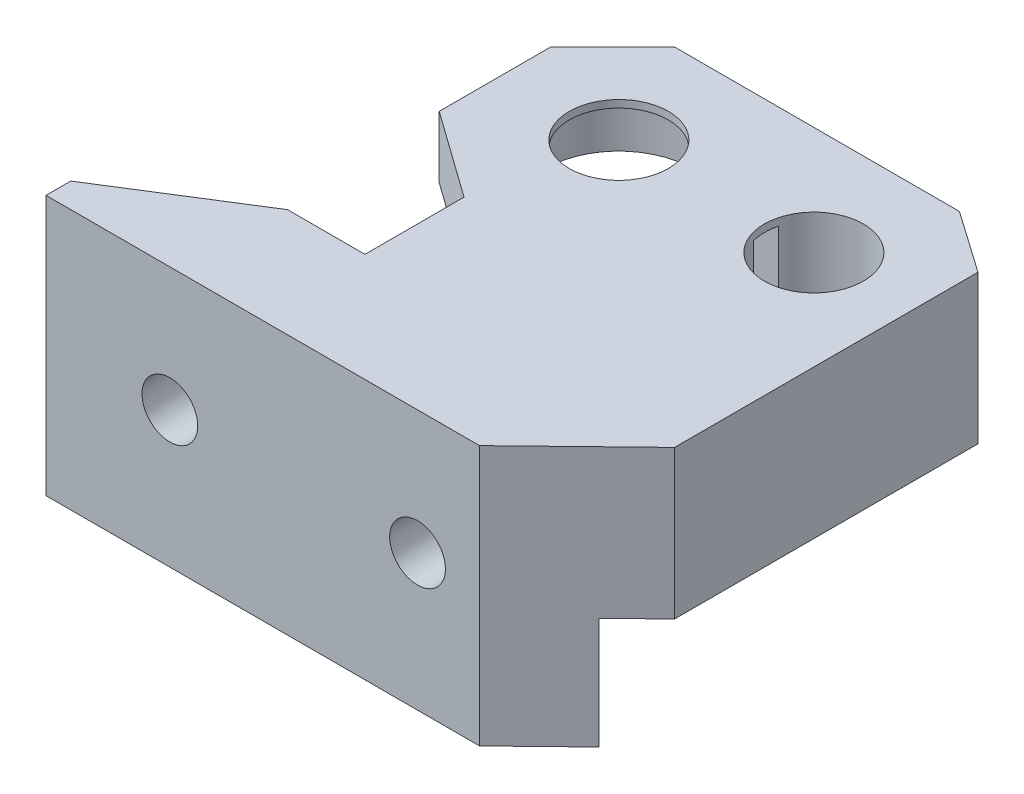
ISO-10303-21;
HEADER;
FILE_DESCRIPTION(('STEP AP214'),'2;1');
FILE_NAME('part.step','',(''),(''),'','','');
FILE_SCHEMA(('AUTOMOTIVE_DESIGN { 1 0 10303 214 1 1 1 1 }'));
ENDSEC;
DATA;
#1=APPLICATION_CONTEXT('core data for automotive mechanical design processes');
#2=APPLICATION_PROTOCOL_DEFINITION('international standard','automotive_design',2000,#1);
#3=PRODUCT_CONTEXT('',#1,'mechanical');
#4=PRODUCT('Part','Part','',(#3));
#5=PRODUCT_RELATED_PRODUCT_CATEGORY('part','',(#4));
#6=PRODUCT_DEFINITION_FORMATION('','',#4);
#7=PRODUCT_DEFINITION_CONTEXT('part definition',#1,'design');
#8=PRODUCT_DEFINITION('design','',#6,#7);
#9=PRODUCT_DEFINITION_SHAPE('','',#8);
#10=(LENGTH_UNIT() NAMED_UNIT(*) SI_UNIT(.MILLI.,.METRE.));
#11=(NAMED_UNIT(*) PLANE_ANGLE_UNIT() SI_UNIT($,.RADIAN.));
#12=(NAMED_UNIT(*) SI_UNIT($,.STERADIAN.) SOLID_ANGLE_UNIT());
#13=UNCERTAINTY_MEASURE_WITH_UNIT(LENGTH_MEASURE(1.E-05),#10,'distance_accuracy_value','');
#14=(GEOMETRIC_REPRESENTATION_CONTEXT(3) GLOBAL_UNCERTAINTY_ASSIGNED_CONTEXT((#13)) GLOBAL_UNIT_ASSIGNED_CONTEXT((#10,
#11,#12)) REPRESENTATION_CONTEXT('',''));
#15=CARTESIAN_POINT('',(0.,0.,0.));
#16=DIRECTION('',(0.,0.,1.));
#17=DIRECTION('',(1.,0.,0.));
#18=AXIS2_PLACEMENT_3D('',#15,#16,#17);
#19=CARTESIAN_POINT('',(-9.25,-5.,-8.75));
#20=DIRECTION('',(0.,0.,1.));
#21=DIRECTION('',(1.,0.,0.));
#22=AXIS2_PLACEMENT_3D('',#19,#20,#21);
#23=CYLINDRICAL_SURFACE('',#22,2.25);
#24=CARTESIAN_POINT('',(-9.25,-5.,27.));
#25=DIRECTION('',(0.,0.,1.));
#26=DIRECTION('',(1.,0.,0.));
#27=AXIS2_PLACEMENT_3D('',#24,#25,#26);
#28=CIRCLE('',#27,2.25);
#29=CARTESIAN_POINT('',(-7.,-5.,27.));
#30=VERTEX_POINT('',#29);
#31=EDGE_CURVE('E579',#30,#30,#28,.T.);
#32=ORIENTED_EDGE('',*,*,#31,.T.);
#33=EDGE_LOOP('',(#32));
#34=FACE_BOUND('',#33,.T.);
#35=CARTESIAN_POINT('',(-9.25,-5.,22.25));
#36=DIRECTION('',(0.,0.,1.));
#37=DIRECTION('',(1.,0.,0.));
#38=AXIS2_PLACEMENT_3D('',#35,#36,#37);
#39=CIRCLE('',#38,2.25);
#40=CARTESIAN_POINT('',(-7.,-5.,22.25));
#41=VERTEX_POINT('',#40);
#42=EDGE_CURVE('E40',#41,#41,#39,.T.);
#43=ORIENTED_EDGE('',*,*,#42,.F.);
#44=EDGE_LOOP('',(#43));
#45=FACE_BOUND('',#44,.T.);
#46=ADVANCED_FACE('F32',(#34,#45),#23,.F.);
#47=CARTESIAN_POINT('',(10.75,-5.,-8.75));
#48=DIRECTION('',(0.,0.,1.));
#49=DIRECTION('',(1.,0.,0.));
#50=AXIS2_PLACEMENT_3D('',#47,#48,#49);
#51=CYLINDRICAL_SURFACE('',#50,2.25);
#52=CARTESIAN_POINT('',(10.75,-5.,27.));
#53=DIRECTION('',(0.,0.,1.));
#54=DIRECTION('',(1.,0.,0.));
#55=AXIS2_PLACEMENT_3D('',#52,#53,#54);
#56=CIRCLE('',#55,2.25);
#57=CARTESIAN_POINT('',(13.,-5.,27.));
#58=VERTEX_POINT('',#57);
#59=EDGE_CURVE('E580',#58,#58,#56,.T.);
#60=ORIENTED_EDGE('',*,*,#59,.T.);
#61=EDGE_LOOP('',(#60));
#62=FACE_BOUND('',#61,.T.);
#63=CARTESIAN_POINT('',(10.75,-5.,22.25));
#64=DIRECTION('',(0.,0.,1.));
#65=DIRECTION('',(1.,0.,0.));
#66=AXIS2_PLACEMENT_3D('',#63,#64,#65);
#67=CIRCLE('',#66,2.25);
#68=CARTESIAN_POINT('',(13.,-5.,22.25));
#69=VERTEX_POINT('',#68);
#70=EDGE_CURVE('E11',#69,#69,#67,.T.);
#71=ORIENTED_EDGE('',*,*,#70,.F.);
#72=EDGE_LOOP('',(#71));
#73=FACE_BOUND('',#72,.T.);
#74=ADVANCED_FACE('F373',(#62,#73),#51,.F.);
#75=CARTESIAN_POINT('',(0.,-7.,0.));
#76=DIRECTION('',(0.,1.,0.));
#77=DIRECTION('',(0.,0.,1.));
#78=AXIS2_PLACEMENT_3D('',#75,#76,#77);
#79=PLANE('',#78);
#80=DIRECTION('',(1.,0.,0.));
#81=VECTOR('',#80,1.);
#82=CARTESIAN_POINT('',(20.25,-7.,18.25));
#83=LINE('',#82,#81);
#84=CARTESIAN_POINT('',(-5.78589838486224,-7.,18.25));
#85=VERTEX_POINT('',#84);
#86=CARTESIAN_POINT('',(7.28589838486225,-7.,18.25));
#87=VERTEX_POINT('',#86);
#88=EDGE_CURVE('E248',#85,#87,#83,.T.);
#89=ORIENTED_EDGE('',*,*,#88,.T.);
#90=DIRECTION('',(0.,0.,-1.));
#91=VECTOR('',#90,1.);
#92=CARTESIAN_POINT('',(7.28589838486225,-7.,22.25));
#93=LINE('',#92,#91);
#94=CARTESIAN_POINT('',(7.28589838486225,-7.,22.25));
#95=VERTEX_POINT('',#94);
#96=EDGE_CURVE('E226',#87,#95,#93,.F.);
#97=ORIENTED_EDGE('',*,*,#96,.T.);
#98=DIRECTION('',(-1.,0.,0.));
#99=VECTOR('',#98,1.);
#100=CARTESIAN_POINT('',(-14.8703703703704,-7.,22.25));
#101=LINE('',#100,#99);
#102=CARTESIAN_POINT('',(-5.78589838486224,-7.,22.25));
#103=VERTEX_POINT('',#102);
#104=EDGE_CURVE('E554',#95,#103,#101,.T.);
#105=ORIENTED_EDGE('',*,*,#104,.T.);
#106=DIRECTION('',(0.,0.,-1.));
#107=VECTOR('',#106,1.);
#108=CARTESIAN_POINT('',(-5.78589838486224,-7.,22.25));
#109=LINE('',#108,#107);
#110=EDGE_CURVE('E241',#103,#85,#109,.T.);
#111=ORIENTED_EDGE('',*,*,#110,.T.);
#112=EDGE_LOOP('',(#89,#97,#105,#111));
#113=FACE_BOUND('',#112,.T.);
#114=ADVANCED_FACE('F379',(#113),#79,.F.);
#115=DIRECTION('',(0.846889988853068,0.,-0.531768132535647));
#116=VECTOR('',#115,1.);
#117=CARTESIAN_POINT('',(-8.5,-7.,18.25));
#118=LINE('',#117,#116);
#119=CARTESIAN_POINT('',(-14.8703703703704,-7.,22.25));
#120=VERTEX_POINT('',#119);
#121=CARTESIAN_POINT('',(-12.7141016151378,-7.,20.8960638048539));
#122=VERTEX_POINT('',#121);
#123=EDGE_CURVE('E249',#120,#122,#118,.T.);
#124=ORIENTED_EDGE('',*,*,#123,.T.);
#125=DIRECTION('',(0.,0.,-1.));
#126=VECTOR('',#125,1.);
#127=CARTESIAN_POINT('',(-12.7141016151378,-7.,22.25));
#128=LINE('',#127,#126);
#129=CARTESIAN_POINT('',(-12.7141016151378,-7.,22.25));
#130=VERTEX_POINT('',#129);
#131=EDGE_CURVE('E560',#122,#130,#128,.F.);
#132=ORIENTED_EDGE('',*,*,#131,.T.);
#133=EDGE_CURVE('E553',#130,#120,#101,.T.);
#134=ORIENTED_EDGE('',*,*,#133,.T.);
#135=EDGE_LOOP('',(#124,#132,#134));
#136=FACE_BOUND('',#135,.T.);
#137=ADVANCED_FACE('F421',(#136),#79,.F.);
#138=CARTESIAN_POINT('',(15.75,5.,0.));
#139=DIRECTION('',(0.,-1.,0.));
#140=DIRECTION('',(0.,0.,-1.));
#141=AXIS2_PLACEMENT_3D('',#138,#139,#140);
#142=CYLINDRICAL_SURFACE('',#141,4.);
#143=CARTESIAN_POINT('',(15.75,5.,0.));
#144=DIRECTION('',(0.,1.,0.));
#145=DIRECTION('',(0.,0.,1.));
#146=AXIS2_PLACEMENT_3D('',#143,#144,#145);
#147=CIRCLE('',#146,4.);
#148=CARTESIAN_POINT('',(15.75,5.,4.));
#149=VERTEX_POINT('',#148);
#150=EDGE_CURVE('E279',#149,#149,#147,.T.);
#151=ORIENTED_EDGE('',*,*,#150,.T.);
#152=EDGE_LOOP('',(#151));
#153=FACE_BOUND('',#152,.T.);
#154=DIRECTION('',(0.,-1.,0.));
#155=VECTOR('',#154,1.);
#156=CARTESIAN_POINT('',(11.8770166537926,5.,-1.));
#157=LINE('',#156,#155);
#158=CARTESIAN_POINT('',(11.8770166537926,-2.5,-1.));
#159=VERTEX_POINT('',#158);
#160=CARTESIAN_POINT('',(11.8770166537926,4.4,-1.));
#161=VERTEX_POINT('',#160);
#162=EDGE_CURVE('E360',#159,#161,#157,.F.);
#163=ORIENTED_EDGE('',*,*,#162,.F.);
#164=CARTESIAN_POINT('',(15.75,-2.5,0.));
#165=DIRECTION('',(0.,-1.,0.));
#166=DIRECTION('',(0.,0.,-1.));
#167=AXIS2_PLACEMENT_3D('',#164,#165,#166);
#168=CIRCLE('',#167,4.);
#169=CARTESIAN_POINT('',(11.8770166537926,-2.5,0.999999999999999));
#170=VERTEX_POINT('',#169);
#171=EDGE_CURVE('E522',#159,#170,#168,.T.);
#172=ORIENTED_EDGE('',*,*,#171,.T.);
#173=DIRECTION('',(0.,-1.,0.));
#174=VECTOR('',#173,1.);
#175=CARTESIAN_POINT('',(11.8770166537926,5.,1.));
#176=LINE('',#175,#174);
#177=CARTESIAN_POINT('',(11.8770166537926,4.4,1.));
#178=VERTEX_POINT('',#177);
#179=EDGE_CURVE('E362',#178,#170,#176,.T.);
#180=ORIENTED_EDGE('',*,*,#179,.F.);
#181=CARTESIAN_POINT('',(15.75,4.4,0.));
#182=DIRECTION('',(0.,-1.,0.));
#183=DIRECTION('',(0.,0.,-1.));
#184=AXIS2_PLACEMENT_3D('',#181,#182,#183);
#185=CIRCLE('',#184,4.);
#186=EDGE_CURVE('E364',#178,#161,#185,.T.);
#187=ORIENTED_EDGE('',*,*,#186,.T.);
#188=EDGE_LOOP('',(#163,#172,#180,#187));
#189=FACE_BOUND('',#188,.T.);
#190=ADVANCED_FACE('F406',(#153,#189),#142,.F.);
#191=CARTESIAN_POINT('',(15.75,-2.5,0.));
#192=DIRECTION('',(0.,-1.,0.));
#193=DIRECTION('',(0.,0.,-1.));
#194=AXIS2_PLACEMENT_3D('',#191,#192,#193);
#195=PLANE('',#194);
#196=ORIENTED_EDGE('',*,*,#171,.F.);
#197=DIRECTION('',(-1.,0.,0.));
#198=VECTOR('',#197,1.);
#199=CARTESIAN_POINT('',(15.75,-2.5,-1.));
#200=LINE('',#199,#198);
#201=CARTESIAN_POINT('',(8.82179676972449,-2.5,-1.));
#202=VERTEX_POINT('',#201);
#203=EDGE_CURVE('E591',#159,#202,#200,.T.);
#204=ORIENTED_EDGE('',*,*,#203,.T.);
#205=CARTESIAN_POINT('',(15.75,-2.5,0.));
#206=DIRECTION('',(0.,-1.,0.));
#207=DIRECTION('',(0.,0.,-1.));
#208=AXIS2_PLACEMENT_3D('',#205,#206,#207);
#209=CIRCLE('',#208,7.);
#210=CARTESIAN_POINT('',(20.380064794363,-2.5,-5.25));
#211=VERTEX_POINT('',#210);
#212=EDGE_CURVE('E524',#202,#211,#209,.T.);
#213=ORIENTED_EDGE('',*,*,#212,.T.);
#214=DIRECTION('',(1.,0.,0.));
#215=VECTOR('',#214,1.);
#216=CARTESIAN_POINT('',(23.75,-2.5,-5.25));
#217=LINE('',#216,#215);
#218=CARTESIAN_POINT('',(20.25,-2.5,-5.25));
#219=VERTEX_POINT('',#218);
#220=EDGE_CURVE('E357',#219,#211,#217,.T.);
#221=ORIENTED_EDGE('',*,*,#220,.F.);
#222=DIRECTION('',(0.,0.,-1.));
#223=VECTOR('',#222,1.);
#224=CARTESIAN_POINT('',(20.25,-2.5,-5.25));
#225=LINE('',#224,#223);
#226=CARTESIAN_POINT('',(20.25,-2.5,5.3619026473818));
#227=VERTEX_POINT('',#226);
#228=EDGE_CURVE('E532',#227,#219,#225,.T.);
#229=ORIENTED_EDGE('',*,*,#228,.F.);
#230=CARTESIAN_POINT('',(8.82179676972449,-2.5,1.));
#231=VERTEX_POINT('',#230);
#232=EDGE_CURVE('E530',#227,#231,#209,.T.);
#233=ORIENTED_EDGE('',*,*,#232,.T.);
#234=DIRECTION('',(1.,0.,0.));
#235=VECTOR('',#234,1.);
#236=CARTESIAN_POINT('',(15.75,-2.5,0.999999999999999));
#237=LINE('',#236,#235);
#238=EDGE_CURVE('E586',#231,#170,#237,.T.);
#239=ORIENTED_EDGE('',*,*,#238,.T.);
#240=EDGE_LOOP('',(#196,#204,#213,#221,#229,#233,#239));
#241=FACE_BOUND('',#240,.T.);
#242=ADVANCED_FACE('F402',(#241),#195,.T.);
#243=CARTESIAN_POINT('',(15.75,-2.5,0.));
#244=DIRECTION('',(0.,1.,0.));
#245=DIRECTION('',(0.,0.,1.));
#246=AXIS2_PLACEMENT_3D('',#243,#244,#245);
#247=CYLINDRICAL_SURFACE('',#246,7.);
#248=DIRECTION('',(0.,1.,0.));
#249=VECTOR('',#248,1.);
#250=CARTESIAN_POINT('',(8.82179676972449,-2.5,-1.));
#251=LINE('',#250,#249);
#252=CARTESIAN_POINT('',(8.82179676972449,0.,-1.));
#253=VERTEX_POINT('',#252);
#254=EDGE_CURVE('E589',#253,#202,#251,.F.);
#255=ORIENTED_EDGE('',*,*,#254,.F.);
#256=CARTESIAN_POINT('',(15.75,0.,0.));
#257=DIRECTION('',(0.,-1.,0.));
#258=DIRECTION('',(0.,0.,-1.));
#259=AXIS2_PLACEMENT_3D('',#256,#257,#258);
#260=CIRCLE('',#259,7.);
#261=CARTESIAN_POINT('',(20.380064794363,0.,-5.25));
#262=VERTEX_POINT('',#261);
#263=EDGE_CURVE('E519',#253,#262,#260,.T.);
#264=ORIENTED_EDGE('',*,*,#263,.T.);
#265=DIRECTION('',(0.,1.,0.));
#266=VECTOR('',#265,1.);
#267=CARTESIAN_POINT('',(20.380064794363,-2.5,-5.25));
#268=LINE('',#267,#266);
#269=EDGE_CURVE('E265',#262,#211,#268,.F.);
#270=ORIENTED_EDGE('',*,*,#269,.T.);
#271=ORIENTED_EDGE('',*,*,#212,.F.);
#272=EDGE_LOOP('',(#255,#264,#270,#271));
#273=FACE_BOUND('',#272,.T.);
#274=ADVANCED_FACE('F405',(#273),#247,.T.);
#275=DIRECTION('',(0.,1.,0.));
#276=VECTOR('',#275,1.);
#277=CARTESIAN_POINT('',(8.82179676972449,-2.5,1.));
#278=LINE('',#277,#276);
#279=CARTESIAN_POINT('',(8.82179676972449,0.,1.));
#280=VERTEX_POINT('',#279);
#281=EDGE_CURVE('E583',#231,#280,#278,.T.);
#282=ORIENTED_EDGE('',*,*,#281,.F.);
#283=ORIENTED_EDGE('',*,*,#232,.F.);
#284=DIRECTION('',(0.,1.,0.));
#285=VECTOR('',#284,1.);
#286=CARTESIAN_POINT('',(20.25,-2.5,5.3619026473818));
#287=LINE('',#286,#285);
#288=CARTESIAN_POINT('',(20.25,0.,5.3619026473818));
#289=VERTEX_POINT('',#288);
#290=EDGE_CURVE('E47',#227,#289,#287,.T.);
#291=ORIENTED_EDGE('',*,*,#290,.T.);
#292=EDGE_CURVE('E55',#289,#280,#260,.T.);
#293=ORIENTED_EDGE('',*,*,#292,.T.);
#294=EDGE_LOOP('',(#282,#283,#291,#293));
#295=FACE_BOUND('',#294,.T.);
#296=ADVANCED_FACE('F410',(#295),#247,.T.);
#297=CARTESIAN_POINT('',(0.,5.,0.));
#298=DIRECTION('',(0.,-1.,0.));
#299=DIRECTION('',(0.,0.,-1.));
#300=AXIS2_PLACEMENT_3D('',#297,#298,#299);
#301=CYLINDRICAL_SURFACE('',#300,4.);
#302=CARTESIAN_POINT('',(0.,5.,0.));
#303=DIRECTION('',(0.,1.,0.));
#304=DIRECTION('',(0.,0.,1.));
#305=AXIS2_PLACEMENT_3D('',#302,#303,#304);
#306=CIRCLE('',#305,4.);
#307=CARTESIAN_POINT('',(0.,5.,4.));
#308=VERTEX_POINT('',#307);
#309=EDGE_CURVE('E282',#308,#308,#306,.T.);
#310=ORIENTED_EDGE('',*,*,#309,.T.);
#311=EDGE_LOOP('',(#310));
#312=FACE_BOUND('',#311,.T.);
#313=CARTESIAN_POINT('',(0.,4.4,0.));
#314=DIRECTION('',(0.,-1.,0.));
#315=DIRECTION('',(0.,0.,-1.));
#316=AXIS2_PLACEMENT_3D('',#313,#314,#315);
#317=CIRCLE('',#316,4.);
#318=CARTESIAN_POINT('',(0.,4.4,-4.));
#319=VERTEX_POINT('',#318);
#320=EDGE_CURVE('E526',#319,#319,#317,.T.);
#321=ORIENTED_EDGE('',*,*,#320,.T.);
#322=EDGE_LOOP('',(#321));
#323=FACE_BOUND('',#322,.T.);
#324=ADVANCED_FACE('F432',(#312,#323),#301,.F.);
#325=CARTESIAN_POINT('',(0.,0.,0.));
#326=DIRECTION('',(0.,1.,0.));
#327=DIRECTION('',(0.,0.,1.));
#328=AXIS2_PLACEMENT_3D('',#325,#326,#327);
#329=PLANE('',#328);
#330=CARTESIAN_POINT('',(0.,0.,0.));
#331=DIRECTION('',(0.,-1.,0.));
#332=DIRECTION('',(0.,0.,-1.));
#333=AXIS2_PLACEMENT_3D('',#330,#331,#332);
#334=CIRCLE('',#333,5.96815667340306);
#335=CARTESIAN_POINT('',(5.88378229358339,0.,1.));
#336=VERTEX_POINT('',#335);
#337=CARTESIAN_POINT('',(5.88378229358339,0.,-1.));
#338=VERTEX_POINT('',#337);
#339=EDGE_CURVE('E594',#336,#338,#334,.T.);
#340=ORIENTED_EDGE('',*,*,#339,.F.);
#341=DIRECTION('',(-1.,0.,0.));
#342=VECTOR('',#341,1.);
#343=CARTESIAN_POINT('',(5.88378229358339,0.,1.));
#344=LINE('',#343,#342);
#345=EDGE_CURVE('E599',#280,#336,#344,.T.);
#346=ORIENTED_EDGE('',*,*,#345,.F.);
#347=ORIENTED_EDGE('',*,*,#292,.F.);
#348=DIRECTION('',(0.,0.,-1.));
#349=VECTOR('',#348,1.);
#350=CARTESIAN_POINT('',(20.25,0.,-5.25));
#351=LINE('',#350,#349);
#352=CARTESIAN_POINT('',(20.25,0.,18.25));
#353=VERTEX_POINT('',#352);
#354=EDGE_CURVE('E267',#353,#289,#351,.T.);
#355=ORIENTED_EDGE('',*,*,#354,.F.);
#356=DIRECTION('',(1.,0.,0.));
#357=VECTOR('',#356,1.);
#358=CARTESIAN_POINT('',(20.25,0.,18.25));
#359=LINE('',#358,#357);
#360=CARTESIAN_POINT('',(-2.25,0.,18.25));
#361=VERTEX_POINT('',#360);
#362=EDGE_CURVE('E263',#361,#353,#359,.T.);
#363=ORIENTED_EDGE('',*,*,#362,.F.);
#364=DIRECTION('',(0.,0.,1.));
#365=VECTOR('',#364,1.);
#366=CARTESIAN_POINT('',(-2.25,0.,18.25));
#367=LINE('',#366,#365);
#368=CARTESIAN_POINT('',(-2.25,0.,10.25));
#369=VERTEX_POINT('',#368);
#370=EDGE_CURVE('E319',#369,#361,#367,.T.);
#371=ORIENTED_EDGE('',*,*,#370,.F.);
#372=DIRECTION('',(0.813733471206735,0.,0.581238193719096));
#373=VECTOR('',#372,1.);
#374=CARTESIAN_POINT('',(-2.25,0.,10.25));
#375=LINE('',#374,#373);
#376=CARTESIAN_POINT('',(-9.25,0.,5.25));
#377=VERTEX_POINT('',#376);
#378=EDGE_CURVE('E317',#377,#369,#375,.T.);
#379=ORIENTED_EDGE('',*,*,#378,.F.);
#380=DIRECTION('',(0.,0.,1.));
#381=VECTOR('',#380,1.);
#382=CARTESIAN_POINT('',(-9.25,0.,5.25));
#383=LINE('',#382,#381);
#384=CARTESIAN_POINT('',(-9.25,0.,-3.75));
#385=VERTEX_POINT('',#384);
#386=EDGE_CURVE('E315',#385,#377,#383,.T.);
#387=ORIENTED_EDGE('',*,*,#386,.F.);
#388=DIRECTION('',(-0.707106781186548,0.,0.707106781186547));
#389=VECTOR('',#388,1.);
#390=CARTESIAN_POINT('',(-9.25,0.,-3.75));
#391=LINE('',#390,#389);
#392=CARTESIAN_POINT('',(-4.25,0.,-8.75));
#393=VERTEX_POINT('',#392);
#394=EDGE_CURVE('E285',#393,#385,#391,.T.);
#395=ORIENTED_EDGE('',*,*,#394,.F.);
#396=DIRECTION('',(-1.,0.,0.));
#397=VECTOR('',#396,1.);
#398=CARTESIAN_POINT('',(-4.25,0.,-8.75));
#399=LINE('',#398,#397);
#400=CARTESIAN_POINT('',(18.75,0.,-8.75));
#401=VERTEX_POINT('',#400);
#402=EDGE_CURVE('E290',#401,#393,#399,.T.);
#403=ORIENTED_EDGE('',*,*,#402,.F.);
#404=DIRECTION('',(-0.819231920519041,0.,-0.573462344363328));
#405=VECTOR('',#404,1.);
#406=CARTESIAN_POINT('',(18.75,0.,-8.75));
#407=LINE('',#406,#405);
#408=CARTESIAN_POINT('',(23.75,0.,-5.25));
#409=VERTEX_POINT('',#408);
#410=EDGE_CURVE('E322',#409,#401,#407,.T.);
#411=ORIENTED_EDGE('',*,*,#410,.F.);
#412=DIRECTION('',(1.,0.,0.));
#413=VECTOR('',#412,1.);
#414=CARTESIAN_POINT('',(23.75,0.,-5.25));
#415=LINE('',#414,#413);
#416=EDGE_CURVE('E269',#262,#409,#415,.T.);
#417=ORIENTED_EDGE('',*,*,#416,.F.);
#418=ORIENTED_EDGE('',*,*,#263,.F.);
#419=DIRECTION('',(1.,0.,0.));
#420=VECTOR('',#419,1.);
#421=CARTESIAN_POINT('',(5.88378229358339,0.,-1.));
#422=LINE('',#421,#420);
#423=EDGE_CURVE('E521',#338,#253,#422,.T.);
#424=ORIENTED_EDGE('',*,*,#423,.F.);
#425=EDGE_LOOP('',(#340,#346,#347,#355,#363,#371,#379,#387,#395,#403,#411,#417,#418,#424));
#426=FACE_BOUND('',#425,.T.);
#427=ADVANCED_FACE('F435',(#426),#329,.F.);
#428=CARTESIAN_POINT('',(0.,5.,0.));
#429=DIRECTION('',(0.,1.,0.));
#430=DIRECTION('',(0.,0.,1.));
#431=AXIS2_PLACEMENT_3D('',#428,#429,#430);
#432=PLANE('',#431);
#433=ORIENTED_EDGE('',*,*,#309,.F.);
#434=EDGE_LOOP('',(#433));
#435=FACE_BOUND('',#434,.T.);
#436=DIRECTION('',(-0.707106781186548,0.,0.707106781186547));
#437=VECTOR('',#436,1.);
#438=CARTESIAN_POINT('',(-9.25,5.,-3.75));
#439=LINE('',#438,#437);
#440=CARTESIAN_POINT('',(-4.25,5.,-8.75));
#441=VERTEX_POINT('',#440);
#442=CARTESIAN_POINT('',(-9.25,5.,-3.75));
#443=VERTEX_POINT('',#442);
#444=EDGE_CURVE('E286',#441,#443,#439,.T.);
#445=ORIENTED_EDGE('',*,*,#444,.T.);
#446=DIRECTION('',(0.,0.,1.));
#447=VECTOR('',#446,1.);
#448=CARTESIAN_POINT('',(-9.25,5.,5.25));
#449=LINE('',#448,#447);
#450=CARTESIAN_POINT('',(-9.25,5.,5.25));
#451=VERTEX_POINT('',#450);
#452=EDGE_CURVE('E289',#443,#451,#449,.T.);
#453=ORIENTED_EDGE('',*,*,#452,.T.);
#454=DIRECTION('',(0.813733471206735,0.,0.581238193719096));
#455=VECTOR('',#454,1.);
#456=CARTESIAN_POINT('',(-2.25,5.,10.25));
#457=LINE('',#456,#455);
#458=CARTESIAN_POINT('',(-2.25,5.,10.25));
#459=VERTEX_POINT('',#458);
#460=EDGE_CURVE('E292',#451,#459,#457,.T.);
#461=ORIENTED_EDGE('',*,*,#460,.T.);
#462=DIRECTION('',(0.,0.,1.));
#463=VECTOR('',#462,1.);
#464=CARTESIAN_POINT('',(-2.25,5.,18.25));
#465=LINE('',#464,#463);
#466=CARTESIAN_POINT('',(-2.25,5.,18.25));
#467=VERTEX_POINT('',#466);
#468=EDGE_CURVE('E294',#459,#467,#465,.T.);
#469=ORIENTED_EDGE('',*,*,#468,.T.);
#470=DIRECTION('',(-1.,0.,0.));
#471=VECTOR('',#470,1.);
#472=CARTESIAN_POINT('',(-8.5,5.,18.25));
#473=LINE('',#472,#471);
#474=CARTESIAN_POINT('',(-8.5,5.,18.25));
#475=VERTEX_POINT('',#474);
#476=EDGE_CURVE('E296',#467,#475,#473,.T.);
#477=ORIENTED_EDGE('',*,*,#476,.T.);
#478=DIRECTION('',(-0.846889988853068,0.,0.531768132535647));
#479=VECTOR('',#478,1.);
#480=CARTESIAN_POINT('',(-19.25,5.,25.));
#481=LINE('',#480,#479);
#482=CARTESIAN_POINT('',(-19.25,5.,25.));
#483=VERTEX_POINT('',#482);
#484=EDGE_CURVE('E298',#475,#483,#481,.T.);
#485=ORIENTED_EDGE('',*,*,#484,.T.);
#486=DIRECTION('',(0.,0.,1.));
#487=VECTOR('',#486,1.);
#488=CARTESIAN_POINT('',(-19.25,5.,27.));
#489=LINE('',#488,#487);
#490=CARTESIAN_POINT('',(-19.25,5.,27.));
#491=VERTEX_POINT('',#490);
#492=EDGE_CURVE('E300',#483,#491,#489,.T.);
#493=ORIENTED_EDGE('',*,*,#492,.T.);
#494=DIRECTION('',(1.,0.,0.));
#495=VECTOR('',#494,1.);
#496=CARTESIAN_POINT('',(15.75,5.,27.));
#497=LINE('',#496,#495);
#498=CARTESIAN_POINT('',(15.75,5.,27.));
#499=VERTEX_POINT('',#498);
#500=EDGE_CURVE('E302',#491,#499,#497,.T.);
#501=ORIENTED_EDGE('',*,*,#500,.T.);
#502=DIRECTION('',(0.718240222789174,0.,-0.695795215827012));
#503=VECTOR('',#502,1.);
#504=CARTESIAN_POINT('',(23.75,5.,19.25));
#505=LINE('',#504,#503);
#506=CARTESIAN_POINT('',(23.75,5.,19.25));
#507=VERTEX_POINT('',#506);
#508=EDGE_CURVE('E304',#499,#507,#505,.T.);
#509=ORIENTED_EDGE('',*,*,#508,.T.);
#510=DIRECTION('',(0.,0.,-1.));
#511=VECTOR('',#510,1.);
#512=CARTESIAN_POINT('',(23.75,5.,-5.25));
#513=LINE('',#512,#511);
#514=CARTESIAN_POINT('',(23.75,5.,-5.25));
#515=VERTEX_POINT('',#514);
#516=EDGE_CURVE('E306',#507,#515,#513,.T.);
#517=ORIENTED_EDGE('',*,*,#516,.T.);
#518=DIRECTION('',(-0.819231920519041,0.,-0.573462344363328));
#519=VECTOR('',#518,1.);
#520=CARTESIAN_POINT('',(18.75,5.,-8.75));
#521=LINE('',#520,#519);
#522=CARTESIAN_POINT('',(18.75,5.,-8.75));
#523=VERTEX_POINT('',#522);
#524=EDGE_CURVE('E308',#515,#523,#521,.T.);
#525=ORIENTED_EDGE('',*,*,#524,.T.);
#526=DIRECTION('',(-1.,0.,0.));
#527=VECTOR('',#526,1.);
#528=CARTESIAN_POINT('',(-4.25,5.,-8.75));
#529=LINE('',#528,#527);
#530=EDGE_CURVE('E310',#523,#441,#529,.T.);
#531=ORIENTED_EDGE('',*,*,#530,.T.);
#532=EDGE_LOOP('',(#445,#453,#461,#469,#477,#485,#493,#501,#509,#517,#525,#531));
#533=FACE_BOUND('',#532,.T.);
#534=ORIENTED_EDGE('',*,*,#150,.F.);
#535=EDGE_LOOP('',(#534));
#536=FACE_BOUND('',#535,.T.);
#537=ADVANCED_FACE('F437',(#435,#533,#536),#432,.T.);
#538=CARTESIAN_POINT('',(-9.25,5.,-3.75));
#539=DIRECTION('',(0.707106781186547,0.,0.707106781186548));
#540=DIRECTION('',(0.707106781186548,0.,-0.707106781186547));
#541=AXIS2_PLACEMENT_3D('',#538,#539,#540);
#542=PLANE('',#541);
#543=ORIENTED_EDGE('',*,*,#394,.T.);
#544=DIRECTION('',(0.,-1.,0.));
#545=VECTOR('',#544,1.);
#546=CARTESIAN_POINT('',(-9.25,5.,-3.75));
#547=LINE('',#546,#545);
#548=EDGE_CURVE('E266',#443,#385,#547,.T.);
#549=ORIENTED_EDGE('',*,*,#548,.F.);
#550=ORIENTED_EDGE('',*,*,#444,.F.);
#551=DIRECTION('',(0.,-1.,0.));
#552=VECTOR('',#551,1.);
#553=CARTESIAN_POINT('',(-4.25,5.,-8.75));
#554=LINE('',#553,#552);
#555=EDGE_CURVE('E312',#441,#393,#554,.T.);
#556=ORIENTED_EDGE('',*,*,#555,.T.);
#557=EDGE_LOOP('',(#543,#549,#550,#556));
#558=FACE_BOUND('',#557,.T.);
#559=ADVANCED_FACE('F34',(#558),#542,.F.);
#560=CARTESIAN_POINT('',(-9.25,5.,5.25));
#561=DIRECTION('',(1.,0.,0.));
#562=DIRECTION('',(0.,0.,-1.));
#563=AXIS2_PLACEMENT_3D('',#560,#561,#562);
#564=PLANE('',#563);
#565=ORIENTED_EDGE('',*,*,#386,.T.);
#566=DIRECTION('',(0.,-1.,0.));
#567=VECTOR('',#566,1.);
#568=CARTESIAN_POINT('',(-9.25,5.,5.25));
#569=LINE('',#568,#567);
#570=EDGE_CURVE('E350',#451,#377,#569,.T.);
#571=ORIENTED_EDGE('',*,*,#570,.F.);
#572=ORIENTED_EDGE('',*,*,#452,.F.);
#573=ORIENTED_EDGE('',*,*,#548,.T.);
#574=EDGE_LOOP('',(#565,#571,#572,#573));
#575=FACE_BOUND('',#574,.T.);
#576=ADVANCED_FACE('F478',(#575),#564,.F.);
#577=CARTESIAN_POINT('',(-2.25,5.,10.25));
#578=DIRECTION('',(0.581238193719096,0.,-0.813733471206735));
#579=DIRECTION('',(-0.813733471206735,0.,-0.581238193719096));
#580=AXIS2_PLACEMENT_3D('',#577,#578,#579);
#581=PLANE('',#580);
#582=ORIENTED_EDGE('',*,*,#378,.T.);
#583=DIRECTION('',(0.,-1.,0.));
#584=VECTOR('',#583,1.);
#585=CARTESIAN_POINT('',(-2.25,5.,10.25));
#586=LINE('',#585,#584);
#587=EDGE_CURVE('E347',#459,#369,#586,.T.);
#588=ORIENTED_EDGE('',*,*,#587,.F.);
#589=ORIENTED_EDGE('',*,*,#460,.F.);
#590=ORIENTED_EDGE('',*,*,#570,.T.);
#591=EDGE_LOOP('',(#582,#588,#589,#590));
#592=FACE_BOUND('',#591,.T.);
#593=ADVANCED_FACE('F475',(#592),#581,.F.);
#594=CARTESIAN_POINT('',(-2.25,5.,18.25));
#595=DIRECTION('',(1.,0.,0.));
#596=DIRECTION('',(0.,0.,-1.));
#597=AXIS2_PLACEMENT_3D('',#594,#595,#596);
#598=PLANE('',#597);
#599=ORIENTED_EDGE('',*,*,#370,.T.);
#600=DIRECTION('',(0.,-1.,0.));
#601=VECTOR('',#600,1.);
#602=CARTESIAN_POINT('',(-2.25,5.,18.25));
#603=LINE('',#602,#601);
#604=EDGE_CURVE('E344',#467,#361,#603,.T.);
#605=ORIENTED_EDGE('',*,*,#604,.F.);
#606=ORIENTED_EDGE('',*,*,#468,.F.);
#607=ORIENTED_EDGE('',*,*,#587,.T.);
#608=EDGE_LOOP('',(#599,#605,#606,#607));
#609=FACE_BOUND('',#608,.T.);
#610=ADVANCED_FACE('F472',(#609),#598,.F.);
#611=CARTESIAN_POINT('',(-8.5,5.,18.25));
#612=DIRECTION('',(0.,0.,1.));
#613=DIRECTION('',(1.,0.,0.));
#614=AXIS2_PLACEMENT_3D('',#611,#612,#613);
#615=PLANE('',#614);
#616=CARTESIAN_POINT('',(14.2141016151378,-7.,18.25));
#617=VERTEX_POINT('',#616);
#618=CARTESIAN_POINT('',(20.25,-7.,18.25));
#619=VERTEX_POINT('',#618);
#620=EDGE_CURVE('E237',#617,#619,#83,.T.);
#621=ORIENTED_EDGE('',*,*,#620,.F.);
#622=CARTESIAN_POINT('',(10.75,-5.,18.25));
#623=DIRECTION('',(0.,0.,-1.));
#624=DIRECTION('',(-1.,0.,0.));
#625=AXIS2_PLACEMENT_3D('',#622,#623,#624);
#626=CIRCLE('',#625,4.);
#627=EDGE_CURVE('E220',#87,#617,#626,.T.);
#628=ORIENTED_EDGE('',*,*,#627,.F.);
#629=ORIENTED_EDGE('',*,*,#88,.F.);
#630=CARTESIAN_POINT('',(-9.25,-5.,18.25));
#631=DIRECTION('',(0.,0.,-1.));
#632=DIRECTION('',(-1.,0.,0.));
#633=AXIS2_PLACEMENT_3D('',#630,#631,#632);
#634=CIRCLE('',#633,4.);
#635=CARTESIAN_POINT('',(-8.5,-1.07094158862457,18.25));
#636=VERTEX_POINT('',#635);
#637=EDGE_CURVE('E573',#636,#85,#634,.T.);
#638=ORIENTED_EDGE('',*,*,#637,.F.);
#639=DIRECTION('',(0.,-1.,0.));
#640=VECTOR('',#639,1.);
#641=CARTESIAN_POINT('',(-8.5,5.,18.25));
#642=LINE('',#641,#640);
#643=EDGE_CURVE('E341',#475,#636,#642,.T.);
#644=ORIENTED_EDGE('',*,*,#643,.F.);
#645=ORIENTED_EDGE('',*,*,#476,.F.);
#646=ORIENTED_EDGE('',*,*,#604,.T.);
#647=ORIENTED_EDGE('',*,*,#362,.T.);
#648=DIRECTION('',(0.,1.,0.));
#649=VECTOR('',#648,1.);
#650=CARTESIAN_POINT('',(20.25,-7.,18.25));
#651=LINE('',#650,#649);
#652=EDGE_CURVE('E246',#619,#353,#651,.T.);
#653=ORIENTED_EDGE('',*,*,#652,.F.);
#654=EDGE_LOOP('',(#621,#628,#629,#638,#644,#645,#646,#647,#653));
#655=FACE_BOUND('',#654,.T.);
#656=ADVANCED_FACE('F243',(#655),#615,.F.);
#657=CARTESIAN_POINT('',(-19.25,5.,25.));
#658=DIRECTION('',(0.531768132535647,0.,0.846889988853068));
#659=DIRECTION('',(0.846889988853068,0.,-0.531768132535647));
#660=AXIS2_PLACEMENT_3D('',#657,#658,#659);
#661=PLANE('',#660);
#662=ORIENTED_EDGE('',*,*,#643,.T.);
#663=CARTESIAN_POINT('',(-9.25,-5.,18.7209302325581));
#664=DIRECTION('',(0.531768132535647,0.,0.846889988853068));
#665=DIRECTION('',(0.846889988853068,0.,-0.531768132535647));
#666=AXIS2_PLACEMENT_3D('',#663,#664,#665);
#667=ELLIPSE('',#666,4.72316363712971,4.);
#668=EDGE_CURVE('E567',#636,#122,#667,.T.);
#669=ORIENTED_EDGE('',*,*,#668,.T.);
#670=ORIENTED_EDGE('',*,*,#123,.F.);
#671=DIRECTION('',(0.,1.,0.));
#672=VECTOR('',#671,1.);
#673=CARTESIAN_POINT('',(-14.8703703703704,-16.,22.25));
#674=LINE('',#673,#672);
#675=CARTESIAN_POINT('',(-14.8703703703704,-16.,22.25));
#676=VERTEX_POINT('',#675);
#677=EDGE_CURVE('E270',#676,#120,#674,.T.);
#678=ORIENTED_EDGE('',*,*,#677,.F.);
#679=DIRECTION('',(0.846889988853068,0.,-0.531768132535647));
#680=VECTOR('',#679,1.);
#681=CARTESIAN_POINT('',(-19.25,-16.,25.));
#682=LINE('',#681,#680);
#683=CARTESIAN_POINT('',(-19.25,-16.,25.));
#684=VERTEX_POINT('',#683);
#685=EDGE_CURVE('E534',#684,#676,#682,.T.);
#686=ORIENTED_EDGE('',*,*,#685,.F.);
#687=DIRECTION('',(0.,-1.,0.));
#688=VECTOR('',#687,1.);
#689=CARTESIAN_POINT('',(-19.25,5.,25.));
#690=LINE('',#689,#688);
#691=EDGE_CURVE('E339',#483,#684,#690,.T.);
#692=ORIENTED_EDGE('',*,*,#691,.F.);
#693=ORIENTED_EDGE('',*,*,#484,.F.);
#694=EDGE_LOOP('',(#662,#669,#670,#678,#686,#692,#693));
#695=FACE_BOUND('',#694,.T.);
#696=ADVANCED_FACE('F465',(#695),#661,.F.);
#697=CARTESIAN_POINT('',(-19.25,5.,27.));
#698=DIRECTION('',(1.,0.,0.));
#699=DIRECTION('',(0.,0.,-1.));
#700=AXIS2_PLACEMENT_3D('',#697,#698,#699);
#701=PLANE('',#700);
#702=ORIENTED_EDGE('',*,*,#691,.T.);
#703=DIRECTION('',(0.,0.,-1.));
#704=VECTOR('',#703,1.);
#705=CARTESIAN_POINT('',(-19.25,-16.,27.));
#706=LINE('',#705,#704);
#707=CARTESIAN_POINT('',(-19.25,-16.,27.));
#708=VERTEX_POINT('',#707);
#709=EDGE_CURVE('E545',#708,#684,#706,.T.);
#710=ORIENTED_EDGE('',*,*,#709,.F.);
#711=DIRECTION('',(0.,-1.,0.));
#712=VECTOR('',#711,1.);
#713=CARTESIAN_POINT('',(-19.25,5.,27.));
#714=LINE('',#713,#712);
#715=EDGE_CURVE('E337',#491,#708,#714,.T.);
#716=ORIENTED_EDGE('',*,*,#715,.F.);
#717=ORIENTED_EDGE('',*,*,#492,.F.);
#718=EDGE_LOOP('',(#702,#710,#716,#717));
#719=FACE_BOUND('',#718,.T.);
#720=ADVANCED_FACE('F461',(#719),#701,.F.);
#721=CARTESIAN_POINT('',(15.75,5.,27.));
#722=DIRECTION('',(0.,0.,-1.));
#723=DIRECTION('',(-1.,0.,0.));
#724=AXIS2_PLACEMENT_3D('',#721,#722,#723);
#725=PLANE('',#724);
#726=ORIENTED_EDGE('',*,*,#59,.F.);
#727=EDGE_LOOP('',(#726));
#728=FACE_BOUND('',#727,.T.);
#729=ORIENTED_EDGE('',*,*,#31,.F.);
#730=EDGE_LOOP('',(#729));
#731=FACE_BOUND('',#730,.T.);
#732=ORIENTED_EDGE('',*,*,#715,.T.);
#733=DIRECTION('',(-1.,0.,0.));
#734=VECTOR('',#733,1.);
#735=CARTESIAN_POINT('',(15.75,-16.,27.));
#736=LINE('',#735,#734);
#737=CARTESIAN_POINT('',(15.75,-16.,27.));
#738=VERTEX_POINT('',#737);
#739=EDGE_CURVE('E542',#738,#708,#736,.T.);
#740=ORIENTED_EDGE('',*,*,#739,.F.);
#741=DIRECTION('',(0.,-1.,0.));
#742=VECTOR('',#741,1.);
#743=CARTESIAN_POINT('',(15.75,5.,27.));
#744=LINE('',#743,#742);
#745=EDGE_CURVE('E335',#499,#738,#744,.T.);
#746=ORIENTED_EDGE('',*,*,#745,.F.);
#747=ORIENTED_EDGE('',*,*,#500,.F.);
#748=EDGE_LOOP('',(#732,#740,#746,#747));
#749=FACE_BOUND('',#748,.T.);
#750=ADVANCED_FACE('F457',(#728,#731,#749),#725,.F.);
#751=CARTESIAN_POINT('',(23.75,5.,19.25));
#752=DIRECTION('',(-0.695795215827012,0.,-0.718240222789174));
#753=DIRECTION('',(-0.718240222789174,0.,0.695795215827012));
#754=AXIS2_PLACEMENT_3D('',#751,#752,#753);
#755=PLANE('',#754);
#756=ORIENTED_EDGE('',*,*,#745,.T.);
#757=DIRECTION('',(-0.718240222789174,0.,0.695795215827012));
#758=VECTOR('',#757,1.);
#759=CARTESIAN_POINT('',(20.6532258064516,-16.,22.25));
#760=LINE('',#759,#758);
#761=CARTESIAN_POINT('',(20.6532258064516,-16.,22.25));
#762=VERTEX_POINT('',#761);
#763=EDGE_CURVE('E539',#762,#738,#760,.T.);
#764=ORIENTED_EDGE('',*,*,#763,.F.);
#765=DIRECTION('',(0.,1.,0.));
#766=VECTOR('',#765,1.);
#767=CARTESIAN_POINT('',(20.6532258064516,-16.,22.25));
#768=LINE('',#767,#766);
#769=CARTESIAN_POINT('',(20.6532258064516,-7.,22.25));
#770=VERTEX_POINT('',#769);
#771=EDGE_CURVE('E548',#762,#770,#768,.T.);
#772=ORIENTED_EDGE('',*,*,#771,.T.);
#773=DIRECTION('',(-0.718240222789174,0.,0.695795215827012));
#774=VECTOR('',#773,1.);
#775=CARTESIAN_POINT('',(20.6532258064516,-7.,22.25));
#776=LINE('',#775,#774);
#777=CARTESIAN_POINT('',(23.75,-7.,19.25));
#778=VERTEX_POINT('',#777);
#779=EDGE_CURVE('E272',#778,#770,#776,.T.);
#780=ORIENTED_EDGE('',*,*,#779,.F.);
#781=DIRECTION('',(0.,-1.,0.));
#782=VECTOR('',#781,1.);
#783=CARTESIAN_POINT('',(23.75,5.,19.25));
#784=LINE('',#783,#782);
#785=EDGE_CURVE('E333',#507,#778,#784,.T.);
#786=ORIENTED_EDGE('',*,*,#785,.F.);
#787=ORIENTED_EDGE('',*,*,#508,.F.);
#788=EDGE_LOOP('',(#756,#764,#772,#780,#786,#787));
#789=FACE_BOUND('',#788,.T.);
#790=ADVANCED_FACE('F453',(#789),#755,.F.);
#791=CARTESIAN_POINT('',(23.75,5.,-5.25));
#792=DIRECTION('',(-1.,0.,0.));
#793=DIRECTION('',(0.,0.,1.));
#794=AXIS2_PLACEMENT_3D('',#791,#792,#793);
#795=PLANE('',#794);
#796=ORIENTED_EDGE('',*,*,#785,.T.);
#797=DIRECTION('',(0.,0.,1.));
#798=VECTOR('',#797,1.);
#799=CARTESIAN_POINT('',(23.75,-7.,19.25));
#800=LINE('',#799,#798);
#801=CARTESIAN_POINT('',(23.75,-7.,-5.25));
#802=VERTEX_POINT('',#801);
#803=EDGE_CURVE('E259',#802,#778,#800,.T.);
#804=ORIENTED_EDGE('',*,*,#803,.F.);
#805=DIRECTION('',(0.,1.,0.));
#806=VECTOR('',#805,1.);
#807=CARTESIAN_POINT('',(23.75,-7.,-5.25));
#808=LINE('',#807,#806);
#809=EDGE_CURVE('E262',#802,#409,#808,.T.);
#810=ORIENTED_EDGE('',*,*,#809,.T.);
#811=DIRECTION('',(0.,-1.,0.));
#812=VECTOR('',#811,1.);
#813=CARTESIAN_POINT('',(23.75,5.,-5.25));
#814=LINE('',#813,#812);
#815=EDGE_CURVE('E330',#515,#409,#814,.T.);
#816=ORIENTED_EDGE('',*,*,#815,.F.);
#817=ORIENTED_EDGE('',*,*,#516,.F.);
#818=EDGE_LOOP('',(#796,#804,#810,#816,#817));
#819=FACE_BOUND('',#818,.T.);
#820=ADVANCED_FACE('F449',(#819),#795,.F.);
#821=CARTESIAN_POINT('',(18.75,5.,-8.75));
#822=DIRECTION('',(-0.573462344363328,0.,0.819231920519041));
#823=DIRECTION('',(0.819231920519041,0.,0.573462344363328));
#824=AXIS2_PLACEMENT_3D('',#821,#822,#823);
#825=PLANE('',#824);
#826=ORIENTED_EDGE('',*,*,#410,.T.);
#827=DIRECTION('',(0.,-1.,0.));
#828=VECTOR('',#827,1.);
#829=CARTESIAN_POINT('',(18.75,5.,-8.75));
#830=LINE('',#829,#828);
#831=EDGE_CURVE('E327',#523,#401,#830,.T.);
#832=ORIENTED_EDGE('',*,*,#831,.F.);
#833=ORIENTED_EDGE('',*,*,#524,.F.);
#834=ORIENTED_EDGE('',*,*,#815,.T.);
#835=EDGE_LOOP('',(#826,#832,#833,#834));
#836=FACE_BOUND('',#835,.T.);
#837=ADVANCED_FACE('F445',(#836),#825,.F.);
#838=CARTESIAN_POINT('',(-4.25,5.,-8.75));
#839=DIRECTION('',(0.,0.,1.));
#840=DIRECTION('',(1.,0.,0.));
#841=AXIS2_PLACEMENT_3D('',#838,#839,#840);
#842=PLANE('',#841);
#843=ORIENTED_EDGE('',*,*,#402,.T.);
#844=ORIENTED_EDGE('',*,*,#555,.F.);
#845=ORIENTED_EDGE('',*,*,#530,.F.);
#846=ORIENTED_EDGE('',*,*,#831,.T.);
#847=EDGE_LOOP('',(#843,#844,#845,#846));
#848=FACE_BOUND('',#847,.T.);
#849=ADVANCED_FACE('F428',(#848),#842,.F.);
#850=CARTESIAN_POINT('',(20.25,-7.,-5.25));
#851=DIRECTION('',(1.,0.,0.));
#852=DIRECTION('',(0.,0.,-1.));
#853=AXIS2_PLACEMENT_3D('',#850,#851,#852);
#854=PLANE('',#853);
#855=ORIENTED_EDGE('',*,*,#290,.F.);
#856=ORIENTED_EDGE('',*,*,#228,.T.);
#857=DIRECTION('',(0.,1.,0.));
#858=VECTOR('',#857,1.);
#859=CARTESIAN_POINT('',(20.25,-7.,-5.25));
#860=LINE('',#859,#858);
#861=CARTESIAN_POINT('',(20.25,-7.,-5.25));
#862=VERTEX_POINT('',#861);
#863=EDGE_CURVE('E275',#862,#219,#860,.T.);
#864=ORIENTED_EDGE('',*,*,#863,.F.);
#865=DIRECTION('',(0.,0.,-1.));
#866=VECTOR('',#865,1.);
#867=CARTESIAN_POINT('',(20.25,-7.,-5.25));
#868=LINE('',#867,#866);
#869=EDGE_CURVE('E251',#619,#862,#868,.T.);
#870=ORIENTED_EDGE('',*,*,#869,.F.);
#871=ORIENTED_EDGE('',*,*,#652,.T.);
#872=ORIENTED_EDGE('',*,*,#354,.T.);
#873=EDGE_LOOP('',(#855,#856,#864,#870,#871,#872));
#874=FACE_BOUND('',#873,.T.);
#875=ADVANCED_FACE('F424',(#874),#854,.F.);
#876=CARTESIAN_POINT('',(23.75,-7.,-5.25));
#877=DIRECTION('',(0.,0.,1.));
#878=DIRECTION('',(1.,0.,0.));
#879=AXIS2_PLACEMENT_3D('',#876,#877,#878);
#880=PLANE('',#879);
#881=ORIENTED_EDGE('',*,*,#863,.T.);
#882=ORIENTED_EDGE('',*,*,#220,.T.);
#883=ORIENTED_EDGE('',*,*,#269,.F.);
#884=ORIENTED_EDGE('',*,*,#416,.T.);
#885=ORIENTED_EDGE('',*,*,#809,.F.);
#886=DIRECTION('',(1.,0.,0.));
#887=VECTOR('',#886,1.);
#888=CARTESIAN_POINT('',(23.75,-7.,-5.25));
#889=LINE('',#888,#887);
#890=EDGE_CURVE('E257',#862,#802,#889,.T.);
#891=ORIENTED_EDGE('',*,*,#890,.F.);
#892=EDGE_LOOP('',(#881,#882,#883,#884,#885,#891));
#893=FACE_BOUND('',#892,.T.);
#894=ADVANCED_FACE('F420',(#893),#880,.F.);
#895=CARTESIAN_POINT('',(14.2141016151378,-7.,22.25));
#896=VERTEX_POINT('',#895);
#897=EDGE_CURVE('E240',#770,#896,#101,.T.);
#898=ORIENTED_EDGE('',*,*,#897,.T.);
#899=DIRECTION('',(0.,0.,-1.));
#900=VECTOR('',#899,1.);
#901=CARTESIAN_POINT('',(14.2141016151378,-7.,22.25));
#902=LINE('',#901,#900);
#903=EDGE_CURVE('E223',#896,#617,#902,.T.);
#904=ORIENTED_EDGE('',*,*,#903,.T.);
#905=ORIENTED_EDGE('',*,*,#620,.T.);
#906=ORIENTED_EDGE('',*,*,#869,.T.);
#907=ORIENTED_EDGE('',*,*,#890,.T.);
#908=ORIENTED_EDGE('',*,*,#803,.T.);
#909=ORIENTED_EDGE('',*,*,#779,.T.);
#910=EDGE_LOOP('',(#898,#904,#905,#906,#907,#908,#909));
#911=FACE_BOUND('',#910,.T.);
#912=ADVANCED_FACE('F236',(#911),#79,.F.);
#913=CARTESIAN_POINT('',(-14.8703703703704,-16.,22.25));
#914=DIRECTION('',(0.,0.,1.));
#915=DIRECTION('',(1.,0.,0.));
#916=AXIS2_PLACEMENT_3D('',#913,#914,#915);
#917=PLANE('',#916);
#918=ORIENTED_EDGE('',*,*,#104,.F.);
#919=CARTESIAN_POINT('',(10.75,-5.,22.25));
#920=DIRECTION('',(0.,0.,-1.));
#921=DIRECTION('',(-1.,0.,0.));
#922=AXIS2_PLACEMENT_3D('',#919,#920,#921);
#923=CIRCLE('',#922,4.);
#924=EDGE_CURVE('E231',#95,#896,#923,.T.);
#925=ORIENTED_EDGE('',*,*,#924,.T.);
#926=ORIENTED_EDGE('',*,*,#897,.F.);
#927=ORIENTED_EDGE('',*,*,#771,.F.);
#928=DIRECTION('',(1.,0.,0.));
#929=VECTOR('',#928,1.);
#930=CARTESIAN_POINT('',(-14.8703703703704,-16.,22.25));
#931=LINE('',#930,#929);
#932=EDGE_CURVE('E537',#676,#762,#931,.T.);
#933=ORIENTED_EDGE('',*,*,#932,.F.);
#934=ORIENTED_EDGE('',*,*,#677,.T.);
#935=ORIENTED_EDGE('',*,*,#133,.F.);
#936=CARTESIAN_POINT('',(-9.25,-5.,22.25));
#937=DIRECTION('',(0.,0.,-1.));
#938=DIRECTION('',(-1.,0.,0.));
#939=AXIS2_PLACEMENT_3D('',#936,#937,#938);
#940=CIRCLE('',#939,4.);
#941=EDGE_CURVE('E232',#130,#103,#940,.T.);
#942=ORIENTED_EDGE('',*,*,#941,.T.);
#943=EDGE_LOOP('',(#918,#925,#926,#927,#933,#934,#935,#942));
#944=FACE_BOUND('',#943,.T.);
#945=ORIENTED_EDGE('',*,*,#42,.T.);
#946=EDGE_LOOP('',(#945));
#947=FACE_BOUND('',#946,.T.);
#948=ORIENTED_EDGE('',*,*,#70,.T.);
#949=EDGE_LOOP('',(#948));
#950=FACE_BOUND('',#949,.T.);
#951=ADVANCED_FACE('F369',(#944,#947,#950),#917,.F.);
#952=CARTESIAN_POINT('',(0.,-16.,0.));
#953=DIRECTION('',(0.,1.,0.));
#954=DIRECTION('',(0.,0.,1.));
#955=AXIS2_PLACEMENT_3D('',#952,#953,#954);
#956=PLANE('',#955);
#957=ORIENTED_EDGE('',*,*,#685,.T.);
#958=ORIENTED_EDGE('',*,*,#932,.T.);
#959=ORIENTED_EDGE('',*,*,#763,.T.);
#960=ORIENTED_EDGE('',*,*,#739,.T.);
#961=ORIENTED_EDGE('',*,*,#709,.T.);
#962=EDGE_LOOP('',(#957,#958,#959,#960,#961));
#963=FACE_BOUND('',#962,.T.);
#964=ADVANCED_FACE('F400',(#963),#956,.F.);
#965=CARTESIAN_POINT('',(0.,4.4,0.));
#966=DIRECTION('',(0.,-1.,0.));
#967=DIRECTION('',(0.,0.,-1.));
#968=AXIS2_PLACEMENT_3D('',#965,#966,#967);
#969=CYLINDRICAL_SURFACE('',#968,5.96815667340306);
#970=ORIENTED_EDGE('',*,*,#339,.T.);
#971=DIRECTION('',(0.,-1.,0.));
#972=VECTOR('',#971,1.);
#973=CARTESIAN_POINT('',(5.88378229358339,4.4,-1.));
#974=LINE('',#973,#972);
#975=CARTESIAN_POINT('',(5.88378229358339,4.4,-1.));
#976=VERTEX_POINT('',#975);
#977=EDGE_CURVE('E604',#976,#338,#974,.T.);
#978=ORIENTED_EDGE('',*,*,#977,.F.);
#979=CARTESIAN_POINT('',(0.,4.4,0.));
#980=DIRECTION('',(0.,-1.,0.));
#981=DIRECTION('',(0.,0.,-1.));
#982=AXIS2_PLACEMENT_3D('',#979,#980,#981);
#983=CIRCLE('',#982,5.96815667340306);
#984=CARTESIAN_POINT('',(5.88378229358339,4.4,1.));
#985=VERTEX_POINT('',#984);
#986=EDGE_CURVE('E595',#985,#976,#983,.T.);
#987=ORIENTED_EDGE('',*,*,#986,.F.);
#988=DIRECTION('',(0.,-1.,0.));
#989=VECTOR('',#988,1.);
#990=CARTESIAN_POINT('',(5.88378229358339,4.4,1.));
#991=LINE('',#990,#989);
#992=EDGE_CURVE('E609',#985,#336,#991,.T.);
#993=ORIENTED_EDGE('',*,*,#992,.T.);
#994=EDGE_LOOP('',(#970,#978,#987,#993));
#995=FACE_BOUND('',#994,.T.);
#996=ADVANCED_FACE('F393',(#995),#969,.F.);
#997=CARTESIAN_POINT('',(5.88378229358339,4.4,1.));
#998=DIRECTION('',(0.,0.,1.));
#999=DIRECTION('',(1.,0.,0.));
#1000=AXIS2_PLACEMENT_3D('',#997,#998,#999);
#1001=PLANE('',#1000);
#1002=ORIENTED_EDGE('',*,*,#179,.T.);
#1003=ORIENTED_EDGE('',*,*,#238,.F.);
#1004=ORIENTED_EDGE('',*,*,#281,.T.);
#1005=ORIENTED_EDGE('',*,*,#345,.T.);
#1006=ORIENTED_EDGE('',*,*,#992,.F.);
#1007=DIRECTION('',(-1.,0.,0.));
#1008=VECTOR('',#1007,1.);
#1009=CARTESIAN_POINT('',(5.88378229358339,4.4,1.));
#1010=LINE('',#1009,#1008);
#1011=EDGE_CURVE('E602',#178,#985,#1010,.T.);
#1012=ORIENTED_EDGE('',*,*,#1011,.F.);
#1013=EDGE_LOOP('',(#1002,#1003,#1004,#1005,#1006,#1012));
#1014=FACE_BOUND('',#1013,.T.);
#1015=ADVANCED_FACE('F390',(#1014),#1001,.F.);
#1016=CARTESIAN_POINT('',(5.88378229358339,4.4,-1.));
#1017=DIRECTION('',(0.,0.,-1.));
#1018=DIRECTION('',(-1.,0.,0.));
#1019=AXIS2_PLACEMENT_3D('',#1016,#1017,#1018);
#1020=PLANE('',#1019);
#1021=ORIENTED_EDGE('',*,*,#162,.T.);
#1022=DIRECTION('',(1.,0.,0.));
#1023=VECTOR('',#1022,1.);
#1024=CARTESIAN_POINT('',(5.88378229358339,4.4,-1.));
#1025=LINE('',#1024,#1023);
#1026=EDGE_CURVE('E598',#976,#161,#1025,.T.);
#1027=ORIENTED_EDGE('',*,*,#1026,.F.);
#1028=ORIENTED_EDGE('',*,*,#977,.T.);
#1029=ORIENTED_EDGE('',*,*,#423,.T.);
#1030=ORIENTED_EDGE('',*,*,#254,.T.);
#1031=ORIENTED_EDGE('',*,*,#203,.F.);
#1032=EDGE_LOOP('',(#1021,#1027,#1028,#1029,#1030,#1031));
#1033=FACE_BOUND('',#1032,.T.);
#1034=ADVANCED_FACE('F388',(#1033),#1020,.F.);
#1035=CARTESIAN_POINT('',(0.,4.4,0.));
#1036=DIRECTION('',(0.,-1.,0.));
#1037=DIRECTION('',(0.,0.,-1.));
#1038=AXIS2_PLACEMENT_3D('',#1035,#1036,#1037);
#1039=PLANE('',#1038);
#1040=ORIENTED_EDGE('',*,*,#320,.F.);
#1041=EDGE_LOOP('',(#1040));
#1042=FACE_BOUND('',#1041,.T.);
#1043=ORIENTED_EDGE('',*,*,#1011,.T.);
#1044=ORIENTED_EDGE('',*,*,#986,.T.);
#1045=ORIENTED_EDGE('',*,*,#1026,.T.);
#1046=ORIENTED_EDGE('',*,*,#186,.F.);
#1047=EDGE_LOOP('',(#1043,#1044,#1045,#1046));
#1048=FACE_BOUND('',#1047,.T.);
#1049=ADVANCED_FACE('F385',(#1042,#1048),#1039,.T.);
#1050=CARTESIAN_POINT('',(10.75,-5.,22.25));
#1051=DIRECTION('',(0.,0.,-1.));
#1052=DIRECTION('',(-1.,0.,0.));
#1053=AXIS2_PLACEMENT_3D('',#1050,#1051,#1052);
#1054=CYLINDRICAL_SURFACE('',#1053,4.);
#1055=ORIENTED_EDGE('',*,*,#627,.T.);
#1056=ORIENTED_EDGE('',*,*,#903,.F.);
#1057=ORIENTED_EDGE('',*,*,#924,.F.);
#1058=ORIENTED_EDGE('',*,*,#96,.F.);
#1059=EDGE_LOOP('',(#1055,#1056,#1057,#1058));
#1060=FACE_BOUND('',#1059,.T.);
#1061=ADVANCED_FACE('F222',(#1060),#1054,.F.);
#1062=CARTESIAN_POINT('',(-9.25,-5.,22.25));
#1063=DIRECTION('',(0.,0.,-1.));
#1064=DIRECTION('',(-1.,0.,0.));
#1065=AXIS2_PLACEMENT_3D('',#1062,#1063,#1064);
#1066=CYLINDRICAL_SURFACE('',#1065,4.);
#1067=ORIENTED_EDGE('',*,*,#941,.F.);
#1068=ORIENTED_EDGE('',*,*,#131,.F.);
#1069=ORIENTED_EDGE('',*,*,#668,.F.);
#1070=ORIENTED_EDGE('',*,*,#637,.T.);
#1071=ORIENTED_EDGE('',*,*,#110,.F.);
#1072=EDGE_LOOP('',(#1067,#1068,#1069,#1070,#1071));
#1073=FACE_BOUND('',#1072,.T.);
#1074=ADVANCED_FACE('F637',(#1073),#1066,.F.);
#1075=CLOSED_SHELL('',(#46,#74,#114,#137,#190,#242,#274,#296,#324,#427,#537,#559,#576,#593,#610,
#656,#696,#720,#750,#790,#820,#837,#849,#875,#894,#912,#951,#964,#996,#1015,#1034,#1049,#1061,#1074));
#1076=MANIFOLD_SOLID_BREP('B2',#1075);
#1077=ADVANCED_BREP_SHAPE_REPRESENTATION('',(#18,#1076),#14);
#1078=SHAPE_DEFINITION_REPRESENTATION(#9,#1077);
ENDSEC;
END-ISO-10303-21;
